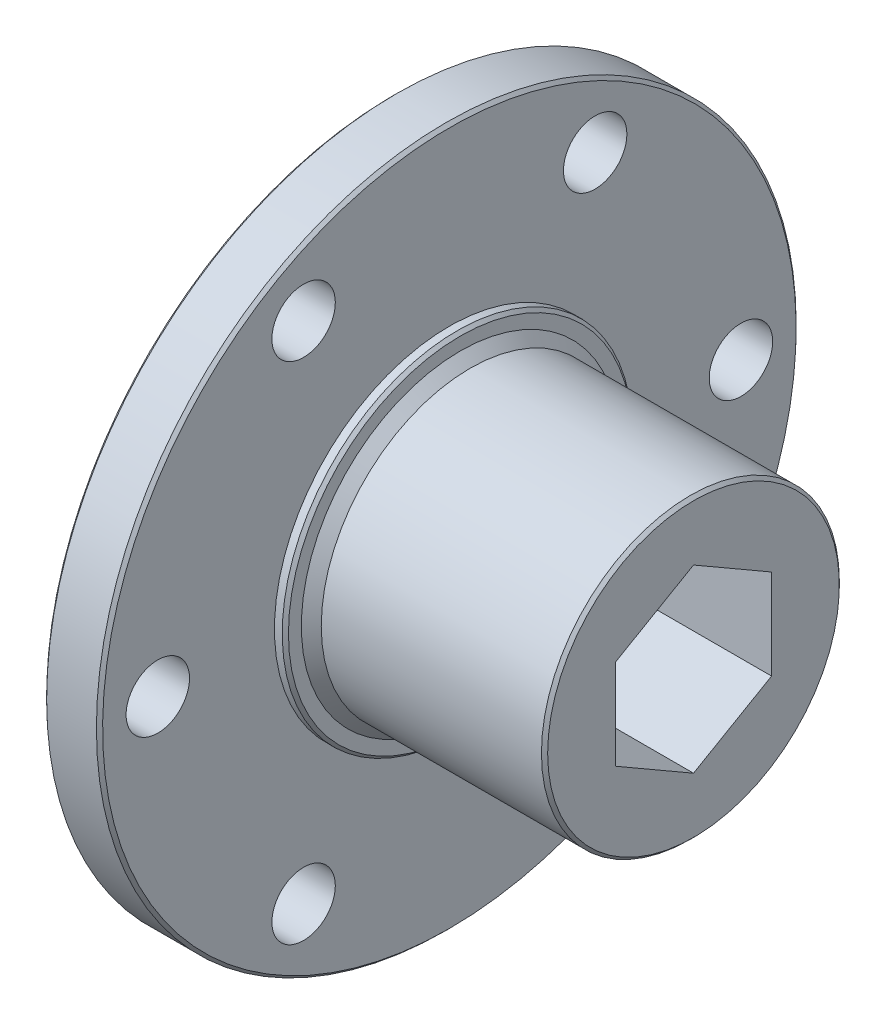
ISO-10303-21;
HEADER;
FILE_DESCRIPTION(('STEP AP214'),'2;1');
FILE_NAME('part.step','',(''),(''),'','','');
FILE_SCHEMA(('AUTOMOTIVE_DESIGN { 1 0 10303 214 1 1 1 1 }'));
ENDSEC;
DATA;
#1=APPLICATION_CONTEXT('core data for automotive mechanical design processes');
#2=APPLICATION_PROTOCOL_DEFINITION('international standard','automotive_design',2000,#1);
#3=PRODUCT_CONTEXT('',#1,'mechanical');
#4=PRODUCT('Part','Part','',(#3));
#5=PRODUCT_RELATED_PRODUCT_CATEGORY('part','',(#4));
#6=PRODUCT_DEFINITION_FORMATION('','',#4);
#7=PRODUCT_DEFINITION_CONTEXT('part definition',#1,'design');
#8=PRODUCT_DEFINITION('design','',#6,#7);
#9=PRODUCT_DEFINITION_SHAPE('','',#8);
#10=(LENGTH_UNIT() NAMED_UNIT(*) SI_UNIT(.MILLI.,.METRE.));
#11=(NAMED_UNIT(*) PLANE_ANGLE_UNIT() SI_UNIT($,.RADIAN.));
#12=(NAMED_UNIT(*) SI_UNIT($,.STERADIAN.) SOLID_ANGLE_UNIT());
#13=UNCERTAINTY_MEASURE_WITH_UNIT(LENGTH_MEASURE(1.E-05),#10,'distance_accuracy_value','');
#14=(GEOMETRIC_REPRESENTATION_CONTEXT(3) GLOBAL_UNCERTAINTY_ASSIGNED_CONTEXT((#13)) GLOBAL_UNIT_ASSIGNED_CONTEXT((#10,
#11,#12)) REPRESENTATION_CONTEXT('',''));
#15=CARTESIAN_POINT('',(0.,0.,0.));
#16=DIRECTION('',(0.,0.,1.));
#17=DIRECTION('',(1.,0.,0.));
#18=AXIS2_PLACEMENT_3D('',#15,#16,#17);
#19=CARTESIAN_POINT('',(6.01493375394323,0.,0.));
#20=DIRECTION('',(-1.,0.,0.));
#21=DIRECTION('',(0.,0.,1.));
#22=AXIS2_PLACEMENT_3D('',#19,#20,#21);
#23=CYLINDRICAL_SURFACE('',#22,12.1666);
#24=CARTESIAN_POINT('',(5.76093375394327,0.,0.));
#25=DIRECTION('',(-1.,0.,0.));
#26=DIRECTION('',(0.,0.,1.));
#27=AXIS2_PLACEMENT_3D('',#24,#25,#26);
#28=CIRCLE('',#27,12.1666);
#29=CARTESIAN_POINT('',(5.76093375394327,0.,12.1666));
#30=VERTEX_POINT('',#29);
#31=EDGE_CURVE('E123',#30,#30,#28,.F.);
#32=ORIENTED_EDGE('',*,*,#31,.F.);
#33=EDGE_LOOP('',(#32));
#34=FACE_BOUND('',#33,.T.);
#35=CARTESIAN_POINT('',(-12.2222662460567,0.,0.));
#36=DIRECTION('',(-1.,0.,0.));
#37=DIRECTION('',(0.,0.,1.));
#38=AXIS2_PLACEMENT_3D('',#35,#36,#37);
#39=CIRCLE('',#38,12.1666);
#40=CARTESIAN_POINT('',(-12.2222662460567,0.,12.1666));
#41=VERTEX_POINT('',#40);
#42=EDGE_CURVE('E119',#41,#41,#39,.T.);
#43=ORIENTED_EDGE('',*,*,#42,.F.);
#44=EDGE_LOOP('',(#43));
#45=FACE_BOUND('',#44,.T.);
#46=ADVANCED_FACE('F18',(#34,#45),#23,.T.);
#47=CARTESIAN_POINT('',(5.76093375394327,0.,0.));
#48=DIRECTION('',(-1.,0.,0.));
#49=DIRECTION('',(0.,0.,1.));
#50=AXIS2_PLACEMENT_3D('',#47,#48,#49);
#51=CONICAL_SURFACE('',#50,12.1666,0.785398163397465);
#52=ORIENTED_EDGE('',*,*,#31,.T.);
#53=EDGE_LOOP('',(#52));
#54=FACE_BOUND('',#53,.T.);
#55=CARTESIAN_POINT('',(6.01493375394323,0.,0.));
#56=DIRECTION('',(-1.,0.,0.));
#57=DIRECTION('',(0.,0.,1.));
#58=AXIS2_PLACEMENT_3D('',#55,#56,#57);
#59=CIRCLE('',#58,11.9126);
#60=CARTESIAN_POINT('',(6.01493375394323,0.,11.9126));
#61=VERTEX_POINT('',#60);
#62=EDGE_CURVE('E21',#61,#61,#59,.F.);
#63=ORIENTED_EDGE('',*,*,#62,.F.);
#64=EDGE_LOOP('',(#63));
#65=FACE_BOUND('',#64,.T.);
#66=ADVANCED_FACE('F206',(#54,#65),#51,.T.);
#67=CARTESIAN_POINT('',(-13.0350662460568,0.,0.));
#68=DIRECTION('',(-1.,0.,0.));
#69=DIRECTION('',(0.,-1.,0.));
#70=AXIS2_PLACEMENT_3D('',#67,#68,#69);
#71=CONICAL_SURFACE('',#70,12.9794,0.785398163397438);
#72=ORIENTED_EDGE('',*,*,#42,.T.);
#73=EDGE_LOOP('',(#72));
#74=FACE_BOUND('',#73,.T.);
#75=CARTESIAN_POINT('',(-13.0350662460568,0.,0.));
#76=DIRECTION('',(-1.,0.,0.));
#77=DIRECTION('',(0.,-1.,0.));
#78=AXIS2_PLACEMENT_3D('',#75,#76,#77);
#79=CIRCLE('',#78,12.9794);
#80=CARTESIAN_POINT('',(-13.0350662460568,-12.9794,0.));
#81=VERTEX_POINT('',#80);
#82=EDGE_CURVE('E99',#81,#81,#79,.T.);
#83=ORIENTED_EDGE('',*,*,#82,.F.);
#84=EDGE_LOOP('',(#83));
#85=FACE_BOUND('',#84,.T.);
#86=ADVANCED_FACE('F208',(#74,#85),#71,.T.);
#87=CARTESIAN_POINT('',(6.01493375394323,0.,0.));
#88=DIRECTION('',(1.,0.,0.));
#89=DIRECTION('',(0.,0.,-1.));
#90=AXIS2_PLACEMENT_3D('',#87,#88,#89);
#91=PLANE('',#90);
#92=DIRECTION('',(0.,1.,0.));
#93=VECTOR('',#92,1.);
#94=CARTESIAN_POINT('',(6.01493375394323,-3.68085890619153,-6.37539999999999));
#95=LINE('',#94,#93);
#96=CARTESIAN_POINT('',(6.01493375394323,3.68081890619155,-6.37539999999999));
#97=VERTEX_POINT('',#96);
#98=CARTESIAN_POINT('',(6.01493375394323,-3.68085890619153,-6.37539999999999));
#99=VERTEX_POINT('',#98);
#100=EDGE_CURVE('E109',#97,#99,#95,.F.);
#101=ORIENTED_EDGE('',*,*,#100,.T.);
#102=DIRECTION('',(0.,0.500000000000001,-0.866025403784438));
#103=VECTOR('',#102,1.);
#104=CARTESIAN_POINT('',(6.01493375394323,-7.36169781238308,0.));
#105=LINE('',#104,#103);
#106=CARTESIAN_POINT('',(6.01493375394323,-7.36169781238308,0.));
#107=VERTEX_POINT('',#106);
#108=EDGE_CURVE('E82',#99,#107,#105,.F.);
#109=ORIENTED_EDGE('',*,*,#108,.T.);
#110=DIRECTION('',(0.,-0.500000000000001,-0.866025403784438));
#111=VECTOR('',#110,1.);
#112=CARTESIAN_POINT('',(6.01493375394323,-3.68085890619153,6.3754));
#113=LINE('',#112,#111);
#114=CARTESIAN_POINT('',(6.01493375394323,-3.68085890619153,6.3754));
#115=VERTEX_POINT('',#114);
#116=EDGE_CURVE('E89',#107,#115,#113,.F.);
#117=ORIENTED_EDGE('',*,*,#116,.T.);
#118=DIRECTION('',(0.,-1.,0.));
#119=VECTOR('',#118,1.);
#120=CARTESIAN_POINT('',(6.01493375394323,3.68081890619155,6.3754));
#121=LINE('',#120,#119);
#122=CARTESIAN_POINT('',(6.01493375394323,3.68081890619155,6.3754));
#123=VERTEX_POINT('',#122);
#124=EDGE_CURVE('E197',#115,#123,#121,.F.);
#125=ORIENTED_EDGE('',*,*,#124,.T.);
#126=DIRECTION('',(0.,-0.500000000000001,0.866025403784438));
#127=VECTOR('',#126,1.);
#128=CARTESIAN_POINT('',(6.01493375394323,7.3616578123831,0.));
#129=LINE('',#128,#127);
#130=CARTESIAN_POINT('',(6.01493375394323,7.3616578123831,0.));
#131=VERTEX_POINT('',#130);
#132=EDGE_CURVE('E522',#123,#131,#129,.F.);
#133=ORIENTED_EDGE('',*,*,#132,.T.);
#134=DIRECTION('',(0.,0.500000000000001,0.866025403784438));
#135=VECTOR('',#134,1.);
#136=CARTESIAN_POINT('',(6.01493375394323,3.68081890619155,-6.37539999999999));
#137=LINE('',#136,#135);
#138=EDGE_CURVE('E530',#131,#97,#137,.F.);
#139=ORIENTED_EDGE('',*,*,#138,.T.);
#140=EDGE_LOOP('',(#101,#109,#117,#125,#133,#139));
#141=FACE_BOUND('',#140,.T.);
#142=ORIENTED_EDGE('',*,*,#62,.T.);
#143=EDGE_LOOP('',(#142));
#144=FACE_BOUND('',#143,.T.);
#145=ADVANCED_FACE('F106',(#141,#144),#91,.T.);
#146=CARTESIAN_POINT('',(-13.0350662460568,28.575,0.));
#147=DIRECTION('',(1.,0.,0.));
#148=DIRECTION('',(0.,0.,-1.));
#149=AXIS2_PLACEMENT_3D('',#146,#147,#148);
#150=PLANE('',#149);
#151=ORIENTED_EDGE('',*,*,#82,.T.);
#152=EDGE_LOOP('',(#151));
#153=FACE_BOUND('',#152,.T.);
#154=CARTESIAN_POINT('',(-13.0350662460568,0.,0.));
#155=DIRECTION('',(-1.,0.,0.));
#156=DIRECTION('',(0.,-1.,0.));
#157=AXIS2_PLACEMENT_3D('',#154,#155,#156);
#158=CIRCLE('',#157,14.0335);
#159=CARTESIAN_POINT('',(-13.0350662460568,-14.0335,0.));
#160=VERTEX_POINT('',#159);
#161=EDGE_CURVE('E193',#160,#160,#158,.T.);
#162=ORIENTED_EDGE('',*,*,#161,.F.);
#163=EDGE_LOOP('',(#162));
#164=FACE_BOUND('',#163,.T.);
#165=ADVANCED_FACE('F306',(#153,#164),#150,.T.);
#166=CARTESIAN_POINT('',(-19.3850662460568,-3.68085890619153,6.3754));
#167=DIRECTION('',(0.,-0.866025403784438,0.500000000000001));
#168=DIRECTION('',(0.,-0.500000000000001,-0.866025403784438));
#169=AXIS2_PLACEMENT_3D('',#166,#167,#168);
#170=PLANE('',#169);
#171=DIRECTION('',(1.,0.,0.));
#172=VECTOR('',#171,1.);
#173=CARTESIAN_POINT('',(-19.3850662460568,-7.36169781238308,0.));
#174=LINE('',#173,#172);
#175=CARTESIAN_POINT('',(-19.3850662460568,-7.36169781238308,0.));
#176=VERTEX_POINT('',#175);
#177=EDGE_CURVE('E92',#107,#176,#174,.F.);
#178=ORIENTED_EDGE('',*,*,#177,.T.);
#179=DIRECTION('',(0.,-0.500000000000001,-0.866025403784438));
#180=VECTOR('',#179,1.);
#181=CARTESIAN_POINT('',(-19.3850662460568,-3.68085890619153,6.3754));
#182=LINE('',#181,#180);
#183=CARTESIAN_POINT('',(-19.3850662460568,-3.68085890619153,6.3754));
#184=VERTEX_POINT('',#183);
#185=EDGE_CURVE('E196',#184,#176,#182,.T.);
#186=ORIENTED_EDGE('',*,*,#185,.F.);
#187=DIRECTION('',(1.,0.,0.));
#188=VECTOR('',#187,1.);
#189=CARTESIAN_POINT('',(-19.3850662460568,-3.68085890619153,6.3754));
#190=LINE('',#189,#188);
#191=EDGE_CURVE('E94',#184,#115,#190,.T.);
#192=ORIENTED_EDGE('',*,*,#191,.T.);
#193=ORIENTED_EDGE('',*,*,#116,.F.);
#194=EDGE_LOOP('',(#178,#186,#192,#193));
#195=FACE_BOUND('',#194,.T.);
#196=ADVANCED_FACE('F90',(#195),#170,.F.);
#197=CARTESIAN_POINT('',(-19.3850662460568,-7.36169781238308,0.));
#198=DIRECTION('',(0.,-0.866025403784438,-0.500000000000001));
#199=DIRECTION('',(0.,0.500000000000001,-0.866025403784438));
#200=AXIS2_PLACEMENT_3D('',#197,#198,#199);
#201=PLANE('',#200);
#202=DIRECTION('',(1.,0.,0.));
#203=VECTOR('',#202,1.);
#204=CARTESIAN_POINT('',(-19.3850662460568,-3.68085890619153,-6.37539999999999));
#205=LINE('',#204,#203);
#206=CARTESIAN_POINT('',(-19.3850662460568,-3.68085890619153,-6.37539999999999));
#207=VERTEX_POINT('',#206);
#208=EDGE_CURVE('E111',#99,#207,#205,.F.);
#209=ORIENTED_EDGE('',*,*,#208,.T.);
#210=DIRECTION('',(0.,0.500000000000001,-0.866025403784438));
#211=VECTOR('',#210,1.);
#212=CARTESIAN_POINT('',(-19.3850662460568,-7.36169781238308,0.));
#213=LINE('',#212,#211);
#214=EDGE_CURVE('E102',#176,#207,#213,.T.);
#215=ORIENTED_EDGE('',*,*,#214,.F.);
#216=ORIENTED_EDGE('',*,*,#177,.F.);
#217=ORIENTED_EDGE('',*,*,#108,.F.);
#218=EDGE_LOOP('',(#209,#215,#216,#217));
#219=FACE_BOUND('',#218,.T.);
#220=ADVANCED_FACE('F101',(#219),#201,.F.);
#221=CARTESIAN_POINT('',(-19.3850662460568,-3.68085890619153,-6.37539999999999));
#222=DIRECTION('',(0.,0.,-1.));
#223=DIRECTION('',(0.,1.,0.));
#224=AXIS2_PLACEMENT_3D('',#221,#222,#223);
#225=PLANE('',#224);
#226=DIRECTION('',(1.,0.,0.));
#227=VECTOR('',#226,1.);
#228=CARTESIAN_POINT('',(-19.3850662460568,3.68081890619155,-6.37539999999999));
#229=LINE('',#228,#227);
#230=CARTESIAN_POINT('',(-19.3850662460568,3.68081890619155,-6.37539999999999));
#231=VERTEX_POINT('',#230);
#232=EDGE_CURVE('E533',#97,#231,#229,.F.);
#233=ORIENTED_EDGE('',*,*,#232,.T.);
#234=DIRECTION('',(0.,1.,0.));
#235=VECTOR('',#234,1.);
#236=CARTESIAN_POINT('',(-19.3850662460568,0.,-6.37539999999999));
#237=LINE('',#236,#235);
#238=EDGE_CURVE('E542',#207,#231,#237,.T.);
#239=ORIENTED_EDGE('',*,*,#238,.F.);
#240=ORIENTED_EDGE('',*,*,#208,.F.);
#241=ORIENTED_EDGE('',*,*,#100,.F.);
#242=EDGE_LOOP('',(#233,#239,#240,#241));
#243=FACE_BOUND('',#242,.T.);
#244=ADVANCED_FACE('F297',(#243),#225,.F.);
#245=CARTESIAN_POINT('',(-19.3850662460568,3.68081890619155,-6.37539999999999));
#246=DIRECTION('',(0.,0.866025403784438,-0.500000000000001));
#247=DIRECTION('',(0.,0.500000000000001,0.866025403784438));
#248=AXIS2_PLACEMENT_3D('',#245,#246,#247);
#249=PLANE('',#248);
#250=DIRECTION('',(1.,0.,0.));
#251=VECTOR('',#250,1.);
#252=CARTESIAN_POINT('',(-19.3850662460568,7.3616578123831,0.));
#253=LINE('',#252,#251);
#254=CARTESIAN_POINT('',(-19.3850662460568,7.3616578123831,0.));
#255=VERTEX_POINT('',#254);
#256=EDGE_CURVE('E526',#131,#255,#253,.F.);
#257=ORIENTED_EDGE('',*,*,#256,.T.);
#258=DIRECTION('',(0.,0.500000000000001,0.866025403784438));
#259=VECTOR('',#258,1.);
#260=CARTESIAN_POINT('',(-19.3850662460568,3.68081890619155,-6.37539999999999));
#261=LINE('',#260,#259);
#262=EDGE_CURVE('E543',#231,#255,#261,.T.);
#263=ORIENTED_EDGE('',*,*,#262,.F.);
#264=ORIENTED_EDGE('',*,*,#232,.F.);
#265=ORIENTED_EDGE('',*,*,#138,.F.);
#266=EDGE_LOOP('',(#257,#263,#264,#265));
#267=FACE_BOUND('',#266,.T.);
#268=ADVANCED_FACE('F293',(#267),#249,.F.);
#269=CARTESIAN_POINT('',(-19.3850662460568,7.3616578123831,0.));
#270=DIRECTION('',(0.,0.866025403784438,0.500000000000001));
#271=DIRECTION('',(0.,-0.500000000000001,0.866025403784438));
#272=AXIS2_PLACEMENT_3D('',#269,#270,#271);
#273=PLANE('',#272);
#274=DIRECTION('',(1.,0.,0.));
#275=VECTOR('',#274,1.);
#276=CARTESIAN_POINT('',(-19.3850662460568,3.68081890619155,6.3754));
#277=LINE('',#276,#275);
#278=CARTESIAN_POINT('',(-19.3850662460568,3.68081890619155,6.3754));
#279=VERTEX_POINT('',#278);
#280=EDGE_CURVE('E519',#123,#279,#277,.F.);
#281=ORIENTED_EDGE('',*,*,#280,.T.);
#282=DIRECTION('',(0.,-0.500000000000001,0.866025403784438));
#283=VECTOR('',#282,1.);
#284=CARTESIAN_POINT('',(-19.3850662460568,7.3616578123831,0.));
#285=LINE('',#284,#283);
#286=EDGE_CURVE('E41',#255,#279,#285,.T.);
#287=ORIENTED_EDGE('',*,*,#286,.F.);
#288=ORIENTED_EDGE('',*,*,#256,.F.);
#289=ORIENTED_EDGE('',*,*,#132,.F.);
#290=EDGE_LOOP('',(#281,#287,#288,#289));
#291=FACE_BOUND('',#290,.T.);
#292=ADVANCED_FACE('F289',(#291),#273,.F.);
#293=CARTESIAN_POINT('',(-19.3850662460568,3.68081890619155,6.3754));
#294=DIRECTION('',(0.,0.,1.));
#295=DIRECTION('',(0.,-1.,0.));
#296=AXIS2_PLACEMENT_3D('',#293,#294,#295);
#297=PLANE('',#296);
#298=ORIENTED_EDGE('',*,*,#191,.F.);
#299=DIRECTION('',(0.,1.,0.));
#300=VECTOR('',#299,1.);
#301=CARTESIAN_POINT('',(-19.3850662460568,0.,6.3754));
#302=LINE('',#301,#300);
#303=EDGE_CURVE('E506',#279,#184,#302,.F.);
#304=ORIENTED_EDGE('',*,*,#303,.F.);
#305=ORIENTED_EDGE('',*,*,#280,.F.);
#306=ORIENTED_EDGE('',*,*,#124,.F.);
#307=EDGE_LOOP('',(#298,#304,#305,#306));
#308=FACE_BOUND('',#307,.T.);
#309=ADVANCED_FACE('F285',(#308),#297,.F.);
#310=CARTESIAN_POINT('',(-13.2890662460568,0.,0.));
#311=DIRECTION('',(-1.,0.,0.));
#312=DIRECTION('',(0.,-1.,0.));
#313=AXIS2_PLACEMENT_3D('',#310,#311,#312);
#314=CONICAL_SURFACE('',#313,14.2875,0.785398163397452);
#315=ORIENTED_EDGE('',*,*,#161,.T.);
#316=EDGE_LOOP('',(#315));
#317=FACE_BOUND('',#316,.T.);
#318=CARTESIAN_POINT('',(-13.2890662460568,0.,0.));
#319=DIRECTION('',(1.,0.,0.));
#320=DIRECTION('',(0.,0.,-1.));
#321=AXIS2_PLACEMENT_3D('',#318,#319,#320);
#322=CIRCLE('',#321,14.2875);
#323=CARTESIAN_POINT('',(-13.2890662460568,0.,-14.2875));
#324=VERTEX_POINT('',#323);
#325=EDGE_CURVE('E504',#324,#324,#322,.F.);
#326=ORIENTED_EDGE('',*,*,#325,.F.);
#327=EDGE_LOOP('',(#326));
#328=FACE_BOUND('',#327,.T.);
#329=ADVANCED_FACE('F282',(#317,#328),#314,.T.);
#330=CARTESIAN_POINT('',(-19.3850662460568,0.,0.));
#331=DIRECTION('',(-1.,0.,0.));
#332=DIRECTION('',(0.,0.,1.));
#333=AXIS2_PLACEMENT_3D('',#330,#331,#332);
#334=PLANE('',#333);
#335=ORIENTED_EDGE('',*,*,#286,.T.);
#336=ORIENTED_EDGE('',*,*,#303,.T.);
#337=ORIENTED_EDGE('',*,*,#185,.T.);
#338=ORIENTED_EDGE('',*,*,#214,.T.);
#339=ORIENTED_EDGE('',*,*,#238,.T.);
#340=ORIENTED_EDGE('',*,*,#262,.T.);
#341=EDGE_LOOP('',(#335,#336,#337,#338,#339,#340));
#342=FACE_BOUND('',#341,.T.);
#343=CARTESIAN_POINT('',(-19.3850662460568,0.,0.));
#344=DIRECTION('',(1.,0.,0.));
#345=DIRECTION('',(0.,0.,-1.));
#346=AXIS2_PLACEMENT_3D('',#343,#344,#345);
#347=CIRCLE('',#346,14.0335);
#348=CARTESIAN_POINT('',(-19.3850662460568,0.,-14.0335));
#349=VERTEX_POINT('',#348);
#350=EDGE_CURVE('E188',#349,#349,#347,.T.);
#351=ORIENTED_EDGE('',*,*,#350,.F.);
#352=EDGE_LOOP('',(#351));
#353=FACE_BOUND('',#352,.T.);
#354=ADVANCED_FACE('F278',(#342,#353),#334,.T.);
#355=CARTESIAN_POINT('',(-14.1780662460568,0.,0.));
#356=DIRECTION('',(-1.,0.,0.));
#357=DIRECTION('',(0.,-1.,0.));
#358=AXIS2_PLACEMENT_3D('',#355,#356,#357);
#359=CONICAL_SURFACE('',#358,28.575,0.785398163397445);
#360=CARTESIAN_POINT('',(-14.1780662460568,0.,0.));
#361=DIRECTION('',(-1.,0.,0.));
#362=DIRECTION('',(0.,0.,1.));
#363=AXIS2_PLACEMENT_3D('',#360,#361,#362);
#364=CIRCLE('',#363,28.575);
#365=CARTESIAN_POINT('',(-14.1780662460568,0.,28.575));
#366=VERTEX_POINT('',#365);
#367=EDGE_CURVE('E192',#366,#366,#364,.T.);
#368=ORIENTED_EDGE('',*,*,#367,.F.);
#369=EDGE_LOOP('',(#368));
#370=FACE_BOUND('',#369,.T.);
#371=CARTESIAN_POINT('',(-13.9240662460568,0.,0.));
#372=DIRECTION('',(-1.,0.,0.));
#373=DIRECTION('',(0.,-1.,0.));
#374=AXIS2_PLACEMENT_3D('',#371,#372,#373);
#375=CIRCLE('',#374,28.321);
#376=CARTESIAN_POINT('',(-13.9240662460568,-28.321,0.));
#377=VERTEX_POINT('',#376);
#378=EDGE_CURVE('E184',#377,#377,#375,.F.);
#379=ORIENTED_EDGE('',*,*,#378,.F.);
#380=EDGE_LOOP('',(#379));
#381=FACE_BOUND('',#380,.T.);
#382=ADVANCED_FACE('F274',(#370,#381),#359,.T.);
#383=CARTESIAN_POINT('',(14.3030238953624,0.,0.));
#384=DIRECTION('',(1.,0.,0.));
#385=DIRECTION('',(0.,0.,-1.));
#386=AXIS2_PLACEMENT_3D('',#383,#384,#385);
#387=CYLINDRICAL_SURFACE('',#386,14.2875);
#388=CARTESIAN_POINT('',(-13.9240662460568,0.,0.));
#389=DIRECTION('',(1.,0.,0.));
#390=DIRECTION('',(0.,0.,-1.));
#391=AXIS2_PLACEMENT_3D('',#388,#389,#390);
#392=CIRCLE('',#391,14.2875);
#393=CARTESIAN_POINT('',(-13.9240662460568,0.,-14.2875));
#394=VERTEX_POINT('',#393);
#395=EDGE_CURVE('E180',#394,#394,#392,.F.);
#396=ORIENTED_EDGE('',*,*,#395,.F.);
#397=EDGE_LOOP('',(#396));
#398=FACE_BOUND('',#397,.T.);
#399=ORIENTED_EDGE('',*,*,#325,.T.);
#400=EDGE_LOOP('',(#399));
#401=FACE_BOUND('',#400,.T.);
#402=ADVANCED_FACE('F270',(#398,#401),#387,.T.);
#403=CARTESIAN_POINT('',(-13.0350662460568,0.,0.));
#404=DIRECTION('',(-1.,0.,0.));
#405=DIRECTION('',(0.,0.,1.));
#406=AXIS2_PLACEMENT_3D('',#403,#404,#405);
#407=CYLINDRICAL_SURFACE('',#406,28.575);
#408=ORIENTED_EDGE('',*,*,#367,.T.);
#409=EDGE_LOOP('',(#408));
#410=FACE_BOUND('',#409,.T.);
#411=CARTESIAN_POINT('',(-18.2420662460568,0.,0.));
#412=DIRECTION('',(1.,0.,0.));
#413=DIRECTION('',(0.,0.,-1.));
#414=AXIS2_PLACEMENT_3D('',#411,#412,#413);
#415=CIRCLE('',#414,28.575);
#416=CARTESIAN_POINT('',(-18.2420662460568,0.,-28.575));
#417=VERTEX_POINT('',#416);
#418=EDGE_CURVE('E179',#417,#417,#415,.F.);
#419=ORIENTED_EDGE('',*,*,#418,.F.);
#420=EDGE_LOOP('',(#419));
#421=FACE_BOUND('',#420,.T.);
#422=ADVANCED_FACE('F266',(#410,#421),#407,.T.);
#423=CARTESIAN_POINT('',(-19.1310662460568,0.,0.));
#424=DIRECTION('',(1.,0.,0.));
#425=DIRECTION('',(0.,0.,-1.));
#426=AXIS2_PLACEMENT_3D('',#423,#424,#425);
#427=CONICAL_SURFACE('',#426,14.2875,0.785398163397452);
#428=CARTESIAN_POINT('',(-19.1310662460568,0.,0.));
#429=DIRECTION('',(1.,0.,0.));
#430=DIRECTION('',(0.,0.,-1.));
#431=AXIS2_PLACEMENT_3D('',#428,#429,#430);
#432=CIRCLE('',#431,14.2875);
#433=CARTESIAN_POINT('',(-19.1310662460568,0.,-14.2875));
#434=VERTEX_POINT('',#433);
#435=EDGE_CURVE('E166',#434,#434,#432,.T.);
#436=ORIENTED_EDGE('',*,*,#435,.F.);
#437=EDGE_LOOP('',(#436));
#438=FACE_BOUND('',#437,.T.);
#439=ORIENTED_EDGE('',*,*,#350,.T.);
#440=EDGE_LOOP('',(#439));
#441=FACE_BOUND('',#440,.T.);
#442=ADVANCED_FACE('F262',(#438,#441),#427,.T.);
#443=CARTESIAN_POINT('',(-13.9240662460568,0.,5.72637987752451));
#444=DIRECTION('',(1.,0.,0.));
#445=DIRECTION('',(0.,0.,-1.));
#446=AXIS2_PLACEMENT_3D('',#443,#444,#445);
#447=PLANE('',#446);
#448=CARTESIAN_POINT('',(-13.9240662460568,0.,23.8125));
#449=DIRECTION('',(1.,0.,0.));
#450=DIRECTION('',(0.,0.,-1.));
#451=AXIS2_PLACEMENT_3D('',#448,#449,#450);
#452=CIRCLE('',#451,2.59080000000001);
#453=CARTESIAN_POINT('',(-13.9240662460568,0.,21.2217));
#454=VERTEX_POINT('',#453);
#455=EDGE_CURVE('E154',#454,#454,#452,.F.);
#456=ORIENTED_EDGE('',*,*,#455,.T.);
#457=EDGE_LOOP('',(#456));
#458=FACE_BOUND('',#457,.T.);
#459=CARTESIAN_POINT('',(-13.9240662460568,20.622229927617,-11.90625));
#460=DIRECTION('',(1.,0.,0.));
#461=DIRECTION('',(0.,0.,-1.));
#462=AXIS2_PLACEMENT_3D('',#459,#460,#461);
#463=CIRCLE('',#462,2.59080000000001);
#464=CARTESIAN_POINT('',(-13.9240662460568,20.622229927617,-14.49705));
#465=VERTEX_POINT('',#464);
#466=EDGE_CURVE('E158',#465,#465,#463,.F.);
#467=ORIENTED_EDGE('',*,*,#466,.T.);
#468=EDGE_LOOP('',(#467));
#469=FACE_BOUND('',#468,.T.);
#470=CARTESIAN_POINT('',(-13.9240662460568,-20.6222299276169,-11.90625));
#471=DIRECTION('',(1.,0.,0.));
#472=DIRECTION('',(0.,0.,-1.));
#473=AXIS2_PLACEMENT_3D('',#470,#471,#472);
#474=CIRCLE('',#473,2.59080000000001);
#475=CARTESIAN_POINT('',(-13.9240662460568,-20.6222299276169,-14.4970500000001));
#476=VERTEX_POINT('',#475);
#477=EDGE_CURVE('E162',#476,#476,#474,.F.);
#478=ORIENTED_EDGE('',*,*,#477,.T.);
#479=EDGE_LOOP('',(#478));
#480=FACE_BOUND('',#479,.T.);
#481=ORIENTED_EDGE('',*,*,#395,.T.);
#482=EDGE_LOOP('',(#481));
#483=FACE_BOUND('',#482,.T.);
#484=CARTESIAN_POINT('',(-13.9240662460568,-20.622229927617,11.9062499999999));
#485=DIRECTION('',(1.,0.,0.));
#486=DIRECTION('',(0.,0.,-1.));
#487=AXIS2_PLACEMENT_3D('',#484,#485,#486);
#488=CIRCLE('',#487,2.59080000000001);
#489=CARTESIAN_POINT('',(-13.9240662460568,-20.622229927617,9.31544999999993));
#490=VERTEX_POINT('',#489);
#491=EDGE_CURVE('E167',#490,#490,#488,.F.);
#492=ORIENTED_EDGE('',*,*,#491,.T.);
#493=EDGE_LOOP('',(#492));
#494=FACE_BOUND('',#493,.T.);
#495=CARTESIAN_POINT('',(-13.9240662460568,0.,-23.8125));
#496=DIRECTION('',(1.,0.,0.));
#497=DIRECTION('',(0.,0.,-1.));
#498=AXIS2_PLACEMENT_3D('',#495,#496,#497);
#499=CIRCLE('',#498,2.59080000000001);
#500=CARTESIAN_POINT('',(-13.9240662460568,0.,-26.4033));
#501=VERTEX_POINT('',#500);
#502=EDGE_CURVE('E171',#501,#501,#499,.F.);
#503=ORIENTED_EDGE('',*,*,#502,.T.);
#504=EDGE_LOOP('',(#503));
#505=FACE_BOUND('',#504,.T.);
#506=CARTESIAN_POINT('',(-13.9240662460568,20.6222299276169,11.90625));
#507=DIRECTION('',(1.,0.,0.));
#508=DIRECTION('',(0.,0.,-1.));
#509=AXIS2_PLACEMENT_3D('',#506,#507,#508);
#510=CIRCLE('',#509,2.59080000000001);
#511=CARTESIAN_POINT('',(-13.9240662460568,20.6222299276169,9.31544999999999));
#512=VERTEX_POINT('',#511);
#513=EDGE_CURVE('E175',#512,#512,#510,.F.);
#514=ORIENTED_EDGE('',*,*,#513,.T.);
#515=EDGE_LOOP('',(#514));
#516=FACE_BOUND('',#515,.T.);
#517=ORIENTED_EDGE('',*,*,#378,.T.);
#518=EDGE_LOOP('',(#517));
#519=FACE_BOUND('',#518,.T.);
#520=ADVANCED_FACE('F258',(#458,#469,#480,#483,#494,#505,#516,#519),#447,.T.);
#521=CARTESIAN_POINT('',(-18.2420662460568,0.,0.));
#522=DIRECTION('',(1.,0.,0.));
#523=DIRECTION('',(0.,0.,-1.));
#524=AXIS2_PLACEMENT_3D('',#521,#522,#523);
#525=CONICAL_SURFACE('',#524,28.575,0.785398163397448);
#526=CARTESIAN_POINT('',(-18.4960662460568,0.,0.));
#527=DIRECTION('',(1.,0.,0.));
#528=DIRECTION('',(0.,0.,-1.));
#529=AXIS2_PLACEMENT_3D('',#526,#527,#528);
#530=CIRCLE('',#529,28.321);
#531=CARTESIAN_POINT('',(-18.4960662460568,0.,-28.321));
#532=VERTEX_POINT('',#531);
#533=EDGE_CURVE('E150',#532,#532,#530,.T.);
#534=ORIENTED_EDGE('',*,*,#533,.T.);
#535=EDGE_LOOP('',(#534));
#536=FACE_BOUND('',#535,.T.);
#537=ORIENTED_EDGE('',*,*,#418,.T.);
#538=EDGE_LOOP('',(#537));
#539=FACE_BOUND('',#538,.T.);
#540=ADVANCED_FACE('F254',(#536,#539),#525,.T.);
#541=CARTESIAN_POINT('',(-13.0350662460568,20.6222299276169,11.90625));
#542=DIRECTION('',(1.,0.,0.));
#543=DIRECTION('',(0.,0.,-1.));
#544=AXIS2_PLACEMENT_3D('',#541,#542,#543);
#545=CYLINDRICAL_SURFACE('',#544,2.59080000000001);
#546=ORIENTED_EDGE('',*,*,#513,.F.);
#547=EDGE_LOOP('',(#546));
#548=FACE_BOUND('',#547,.T.);
#549=CARTESIAN_POINT('',(-18.4960662460568,20.6222299276169,11.90625));
#550=DIRECTION('',(1.,0.,0.));
#551=DIRECTION('',(0.,0.,-1.));
#552=AXIS2_PLACEMENT_3D('',#549,#550,#551);
#553=CIRCLE('',#552,2.59080000000001);
#554=CARTESIAN_POINT('',(-18.4960662460568,20.6222299276169,9.31544999999999));
#555=VERTEX_POINT('',#554);
#556=EDGE_CURVE('E146',#555,#555,#553,.F.);
#557=ORIENTED_EDGE('',*,*,#556,.T.);
#558=EDGE_LOOP('',(#557));
#559=FACE_BOUND('',#558,.T.);
#560=ADVANCED_FACE('F250',(#548,#559),#545,.F.);
#561=CARTESIAN_POINT('',(-13.0350662460568,0.,-23.8125));
#562=DIRECTION('',(1.,0.,0.));
#563=DIRECTION('',(0.,0.,-1.));
#564=AXIS2_PLACEMENT_3D('',#561,#562,#563);
#565=CYLINDRICAL_SURFACE('',#564,2.59080000000001);
#566=ORIENTED_EDGE('',*,*,#502,.F.);
#567=EDGE_LOOP('',(#566));
#568=FACE_BOUND('',#567,.T.);
#569=CARTESIAN_POINT('',(-18.4960662460568,0.,-23.8125));
#570=DIRECTION('',(1.,0.,0.));
#571=DIRECTION('',(0.,0.,-1.));
#572=AXIS2_PLACEMENT_3D('',#569,#570,#571);
#573=CIRCLE('',#572,2.59080000000001);
#574=CARTESIAN_POINT('',(-18.4960662460568,0.,-26.4033));
#575=VERTEX_POINT('',#574);
#576=EDGE_CURVE('E142',#575,#575,#573,.F.);
#577=ORIENTED_EDGE('',*,*,#576,.T.);
#578=EDGE_LOOP('',(#577));
#579=FACE_BOUND('',#578,.T.);
#580=ADVANCED_FACE('F246',(#568,#579),#565,.F.);
#581=CARTESIAN_POINT('',(-13.0350662460568,-20.622229927617,11.9062499999999));
#582=DIRECTION('',(1.,0.,0.));
#583=DIRECTION('',(0.,0.,-1.));
#584=AXIS2_PLACEMENT_3D('',#581,#582,#583);
#585=CYLINDRICAL_SURFACE('',#584,2.59080000000001);
#586=ORIENTED_EDGE('',*,*,#491,.F.);
#587=EDGE_LOOP('',(#586));
#588=FACE_BOUND('',#587,.T.);
#589=CARTESIAN_POINT('',(-18.4960662460568,-20.622229927617,11.9062499999999));
#590=DIRECTION('',(1.,0.,0.));
#591=DIRECTION('',(0.,0.,-1.));
#592=AXIS2_PLACEMENT_3D('',#589,#590,#591);
#593=CIRCLE('',#592,2.59080000000001);
#594=CARTESIAN_POINT('',(-18.4960662460568,-20.622229927617,9.31544999999993));
#595=VERTEX_POINT('',#594);
#596=EDGE_CURVE('E138',#595,#595,#593,.F.);
#597=ORIENTED_EDGE('',*,*,#596,.T.);
#598=EDGE_LOOP('',(#597));
#599=FACE_BOUND('',#598,.T.);
#600=ADVANCED_FACE('F242',(#588,#599),#585,.F.);
#601=CARTESIAN_POINT('',(14.3030238953624,0.,0.));
#602=DIRECTION('',(1.,0.,0.));
#603=DIRECTION('',(0.,0.,-1.));
#604=AXIS2_PLACEMENT_3D('',#601,#602,#603);
#605=CYLINDRICAL_SURFACE('',#604,14.2875);
#606=CARTESIAN_POINT('',(-18.4960662460568,0.,0.));
#607=DIRECTION('',(1.,0.,0.));
#608=DIRECTION('',(0.,0.,-1.));
#609=AXIS2_PLACEMENT_3D('',#606,#607,#608);
#610=CIRCLE('',#609,14.2875);
#611=CARTESIAN_POINT('',(-18.4960662460568,0.,-14.2875));
#612=VERTEX_POINT('',#611);
#613=EDGE_CURVE('E134',#612,#612,#610,.F.);
#614=ORIENTED_EDGE('',*,*,#613,.T.);
#615=EDGE_LOOP('',(#614));
#616=FACE_BOUND('',#615,.T.);
#617=ORIENTED_EDGE('',*,*,#435,.T.);
#618=EDGE_LOOP('',(#617));
#619=FACE_BOUND('',#618,.T.);
#620=ADVANCED_FACE('F238',(#616,#619),#605,.T.);
#621=CARTESIAN_POINT('',(-13.0350662460568,-20.6222299276169,-11.90625));
#622=DIRECTION('',(1.,0.,0.));
#623=DIRECTION('',(0.,0.,-1.));
#624=AXIS2_PLACEMENT_3D('',#621,#622,#623);
#625=CYLINDRICAL_SURFACE('',#624,2.59080000000001);
#626=ORIENTED_EDGE('',*,*,#477,.F.);
#627=EDGE_LOOP('',(#626));
#628=FACE_BOUND('',#627,.T.);
#629=CARTESIAN_POINT('',(-18.4960662460568,-20.6222299276169,-11.90625));
#630=DIRECTION('',(1.,0.,0.));
#631=DIRECTION('',(0.,0.,-1.));
#632=AXIS2_PLACEMENT_3D('',#629,#630,#631);
#633=CIRCLE('',#632,2.59080000000001);
#634=CARTESIAN_POINT('',(-18.4960662460568,-20.6222299276169,-14.4970500000001));
#635=VERTEX_POINT('',#634);
#636=EDGE_CURVE('E130',#635,#635,#633,.F.);
#637=ORIENTED_EDGE('',*,*,#636,.T.);
#638=EDGE_LOOP('',(#637));
#639=FACE_BOUND('',#638,.T.);
#640=ADVANCED_FACE('F234',(#628,#639),#625,.F.);
#641=CARTESIAN_POINT('',(-13.0350662460568,20.622229927617,-11.90625));
#642=DIRECTION('',(1.,0.,0.));
#643=DIRECTION('',(0.,0.,-1.));
#644=AXIS2_PLACEMENT_3D('',#641,#642,#643);
#645=CYLINDRICAL_SURFACE('',#644,2.59080000000001);
#646=ORIENTED_EDGE('',*,*,#466,.F.);
#647=EDGE_LOOP('',(#646));
#648=FACE_BOUND('',#647,.T.);
#649=CARTESIAN_POINT('',(-18.4960662460568,20.622229927617,-11.90625));
#650=DIRECTION('',(1.,0.,0.));
#651=DIRECTION('',(0.,0.,-1.));
#652=AXIS2_PLACEMENT_3D('',#649,#650,#651);
#653=CIRCLE('',#652,2.59080000000001);
#654=CARTESIAN_POINT('',(-18.4960662460568,20.622229927617,-14.49705));
#655=VERTEX_POINT('',#654);
#656=EDGE_CURVE('E28',#655,#655,#653,.F.);
#657=ORIENTED_EDGE('',*,*,#656,.T.);
#658=EDGE_LOOP('',(#657));
#659=FACE_BOUND('',#658,.T.);
#660=ADVANCED_FACE('F226',(#648,#659),#645,.F.);
#661=CARTESIAN_POINT('',(-13.0350662460568,0.,23.8125));
#662=DIRECTION('',(1.,0.,0.));
#663=DIRECTION('',(0.,0.,-1.));
#664=AXIS2_PLACEMENT_3D('',#661,#662,#663);
#665=CYLINDRICAL_SURFACE('',#664,2.59080000000001);
#666=ORIENTED_EDGE('',*,*,#455,.F.);
#667=EDGE_LOOP('',(#666));
#668=FACE_BOUND('',#667,.T.);
#669=CARTESIAN_POINT('',(-18.4960662460568,0.,23.8125));
#670=DIRECTION('',(1.,0.,0.));
#671=DIRECTION('',(0.,0.,-1.));
#672=AXIS2_PLACEMENT_3D('',#669,#670,#671);
#673=CIRCLE('',#672,2.59080000000001);
#674=CARTESIAN_POINT('',(-18.4960662460568,0.,21.2217));
#675=VERTEX_POINT('',#674);
#676=EDGE_CURVE('E11',#675,#675,#673,.F.);
#677=ORIENTED_EDGE('',*,*,#676,.T.);
#678=EDGE_LOOP('',(#677));
#679=FACE_BOUND('',#678,.T.);
#680=ADVANCED_FACE('F220',(#668,#679),#665,.F.);
#681=CARTESIAN_POINT('',(-18.4960662460568,0.,14.2875));
#682=DIRECTION('',(1.,0.,0.));
#683=DIRECTION('',(0.,0.,-1.));
#684=AXIS2_PLACEMENT_3D('',#681,#682,#683);
#685=PLANE('',#684);
#686=ORIENTED_EDGE('',*,*,#676,.F.);
#687=EDGE_LOOP('',(#686));
#688=FACE_BOUND('',#687,.T.);
#689=ORIENTED_EDGE('',*,*,#656,.F.);
#690=EDGE_LOOP('',(#689));
#691=FACE_BOUND('',#690,.T.);
#692=ORIENTED_EDGE('',*,*,#636,.F.);
#693=EDGE_LOOP('',(#692));
#694=FACE_BOUND('',#693,.T.);
#695=ORIENTED_EDGE('',*,*,#613,.F.);
#696=EDGE_LOOP('',(#695));
#697=FACE_BOUND('',#696,.T.);
#698=ORIENTED_EDGE('',*,*,#596,.F.);
#699=EDGE_LOOP('',(#698));
#700=FACE_BOUND('',#699,.T.);
#701=ORIENTED_EDGE('',*,*,#576,.F.);
#702=EDGE_LOOP('',(#701));
#703=FACE_BOUND('',#702,.T.);
#704=ORIENTED_EDGE('',*,*,#556,.F.);
#705=EDGE_LOOP('',(#704));
#706=FACE_BOUND('',#705,.T.);
#707=ORIENTED_EDGE('',*,*,#533,.F.);
#708=EDGE_LOOP('',(#707));
#709=FACE_BOUND('',#708,.T.);
#710=ADVANCED_FACE('F218',(#688,#691,#694,#697,#700,#703,#706,#709),#685,.F.);
#711=CLOSED_SHELL('',(#46,#66,#86,#145,#165,#196,#220,#244,#268,#292,#309,#329,#354,#382,#402,
#422,#442,#520,#540,#560,#580,#600,#620,#640,#660,#680,#710));
#712=MANIFOLD_SOLID_BREP('B1',#711);
#713=ADVANCED_BREP_SHAPE_REPRESENTATION('',(#18,#712),#14);
#714=SHAPE_DEFINITION_REPRESENTATION(#9,#713);
ENDSEC;
END-ISO-10303-21;
